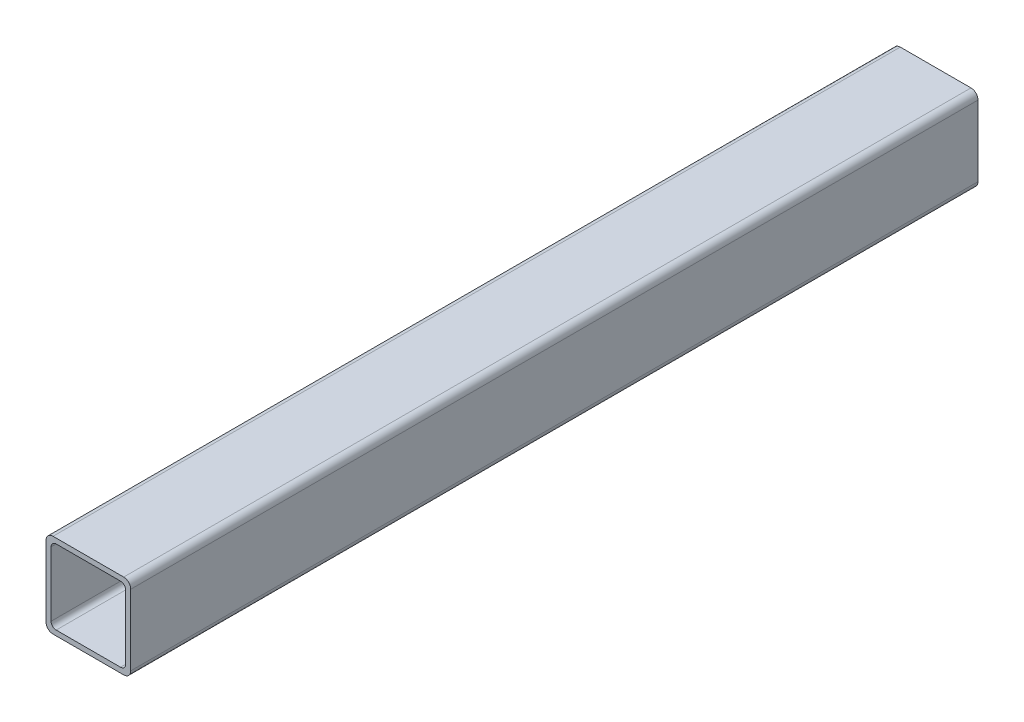
ISO-10303-21;
HEADER;
FILE_DESCRIPTION(('STEP AP214'),'2;1');
FILE_NAME('part.step','',(''),(''),'','','');
FILE_SCHEMA(('AUTOMOTIVE_DESIGN { 1 0 10303 214 1 1 1 1 }'));
ENDSEC;
DATA;
#1=APPLICATION_CONTEXT('core data for automotive mechanical design processes');
#2=APPLICATION_PROTOCOL_DEFINITION('international standard','automotive_design',2000,#1);
#3=PRODUCT_CONTEXT('',#1,'mechanical');
#4=PRODUCT('Part','Part','',(#3));
#5=PRODUCT_RELATED_PRODUCT_CATEGORY('part','',(#4));
#6=PRODUCT_DEFINITION_FORMATION('','',#4);
#7=PRODUCT_DEFINITION_CONTEXT('part definition',#1,'design');
#8=PRODUCT_DEFINITION('design','',#6,#7);
#9=PRODUCT_DEFINITION_SHAPE('','',#8);
#10=(LENGTH_UNIT() NAMED_UNIT(*) SI_UNIT(.MILLI.,.METRE.));
#11=(NAMED_UNIT(*) PLANE_ANGLE_UNIT() SI_UNIT($,.RADIAN.));
#12=(NAMED_UNIT(*) SI_UNIT($,.STERADIAN.) SOLID_ANGLE_UNIT());
#13=UNCERTAINTY_MEASURE_WITH_UNIT(LENGTH_MEASURE(1.E-05),#10,'distance_accuracy_value','');
#14=(GEOMETRIC_REPRESENTATION_CONTEXT(3) GLOBAL_UNCERTAINTY_ASSIGNED_CONTEXT((#13)) GLOBAL_UNIT_ASSIGNED_CONTEXT((#10,
#11,#12)) REPRESENTATION_CONTEXT('',''));
#15=CARTESIAN_POINT('',(0.,0.,0.));
#16=DIRECTION('',(0.,0.,1.));
#17=DIRECTION('',(1.,0.,0.));
#18=AXIS2_PLACEMENT_3D('',#15,#16,#17);
#19=CARTESIAN_POINT('',(-12.7,10.5918,-254.));
#20=DIRECTION('',(-1.,0.,0.));
#21=DIRECTION('',(0.,0.,1.));
#22=AXIS2_PLACEMENT_3D('',#19,#20,#21);
#23=PLANE('',#22);
#24=DIRECTION('',(0.,-1.,0.));
#25=VECTOR('',#24,1.);
#26=CARTESIAN_POINT('',(-12.7,10.5918,0.));
#27=LINE('',#26,#25);
#28=CARTESIAN_POINT('',(-12.7,10.5918,0.));
#29=VERTEX_POINT('',#28);
#30=CARTESIAN_POINT('',(-12.7,-10.5918,0.));
#31=VERTEX_POINT('',#30);
#32=EDGE_CURVE('E11',#29,#31,#27,.T.);
#33=ORIENTED_EDGE('',*,*,#32,.F.);
#34=DIRECTION('',(0.,0.,1.));
#35=VECTOR('',#34,1.);
#36=CARTESIAN_POINT('',(-12.7,10.5918,-254.));
#37=LINE('',#36,#35);
#38=CARTESIAN_POINT('',(-12.7,10.5918,-254.));
#39=VERTEX_POINT('',#38);
#40=EDGE_CURVE('E25',#39,#29,#37,.T.);
#41=ORIENTED_EDGE('',*,*,#40,.F.);
#42=DIRECTION('',(0.,-1.,0.));
#43=VECTOR('',#42,1.);
#44=CARTESIAN_POINT('',(-12.7,10.5918,-254.));
#45=LINE('',#44,#43);
#46=CARTESIAN_POINT('',(-12.7,-10.5918,-254.));
#47=VERTEX_POINT('',#46);
#48=EDGE_CURVE('E331',#39,#47,#45,.T.);
#49=ORIENTED_EDGE('',*,*,#48,.T.);
#50=DIRECTION('',(0.,0.,1.));
#51=VECTOR('',#50,1.);
#52=CARTESIAN_POINT('',(-12.7,-10.5918,-254.));
#53=LINE('',#52,#51);
#54=EDGE_CURVE('E327',#47,#31,#53,.T.);
#55=ORIENTED_EDGE('',*,*,#54,.T.);
#56=EDGE_LOOP('',(#33,#41,#49,#55));
#57=FACE_BOUND('',#56,.T.);
#58=ADVANCED_FACE('F17',(#57),#23,.T.);
#59=CARTESIAN_POINT('',(-10.5917999999997,-10.5917999999997,-254.));
#60=DIRECTION('',(0.,0.,1.));
#61=DIRECTION('',(0.707106781186548,0.707106781186548,0.));
#62=AXIS2_PLACEMENT_3D('',#59,#60,#61);
#63=CYLINDRICAL_SURFACE('',#62,2.10820000000029);
#64=CARTESIAN_POINT('',(-10.5917999999997,-10.5917999999997,0.));
#65=DIRECTION('',(0.,0.,1.));
#66=DIRECTION('',(1.,0.,0.));
#67=AXIS2_PLACEMENT_3D('',#64,#65,#66);
#68=CIRCLE('',#67,2.10820000000029);
#69=CARTESIAN_POINT('',(-10.5918,-12.7,0.));
#70=VERTEX_POINT('',#69);
#71=EDGE_CURVE('E322',#31,#70,#68,.T.);
#72=ORIENTED_EDGE('',*,*,#71,.F.);
#73=ORIENTED_EDGE('',*,*,#54,.F.);
#74=CARTESIAN_POINT('',(-10.5917999999997,-10.5917999999997,-254.));
#75=DIRECTION('',(0.,0.,1.));
#76=DIRECTION('',(1.,0.,0.));
#77=AXIS2_PLACEMENT_3D('',#74,#75,#76);
#78=CIRCLE('',#77,2.10820000000029);
#79=CARTESIAN_POINT('',(-10.5918,-12.7,-254.));
#80=VERTEX_POINT('',#79);
#81=EDGE_CURVE('E318',#47,#80,#78,.T.);
#82=ORIENTED_EDGE('',*,*,#81,.T.);
#83=DIRECTION('',(0.,0.,1.));
#84=VECTOR('',#83,1.);
#85=CARTESIAN_POINT('',(-10.5918,-12.7,-254.));
#86=LINE('',#85,#84);
#87=EDGE_CURVE('E314',#80,#70,#86,.T.);
#88=ORIENTED_EDGE('',*,*,#87,.T.);
#89=EDGE_LOOP('',(#72,#73,#82,#88));
#90=FACE_BOUND('',#89,.T.);
#91=ADVANCED_FACE('F353',(#90),#63,.T.);
#92=CARTESIAN_POINT('',(-10.5918,-12.7,-254.));
#93=DIRECTION('',(0.,-1.,0.));
#94=DIRECTION('',(0.,0.,-1.));
#95=AXIS2_PLACEMENT_3D('',#92,#93,#94);
#96=PLANE('',#95);
#97=DIRECTION('',(1.,0.,0.));
#98=VECTOR('',#97,1.);
#99=CARTESIAN_POINT('',(-10.5918,-12.7,0.));
#100=LINE('',#99,#98);
#101=CARTESIAN_POINT('',(10.5918,-12.7,0.));
#102=VERTEX_POINT('',#101);
#103=EDGE_CURVE('E309',#70,#102,#100,.T.);
#104=ORIENTED_EDGE('',*,*,#103,.F.);
#105=ORIENTED_EDGE('',*,*,#87,.F.);
#106=DIRECTION('',(1.,0.,0.));
#107=VECTOR('',#106,1.);
#108=CARTESIAN_POINT('',(-10.5918,-12.7,-254.));
#109=LINE('',#108,#107);
#110=CARTESIAN_POINT('',(10.5918,-12.7,-254.));
#111=VERTEX_POINT('',#110);
#112=EDGE_CURVE('E305',#80,#111,#109,.T.);
#113=ORIENTED_EDGE('',*,*,#112,.T.);
#114=DIRECTION('',(0.,0.,1.));
#115=VECTOR('',#114,1.);
#116=CARTESIAN_POINT('',(10.5918,-12.7,-254.));
#117=LINE('',#116,#115);
#118=EDGE_CURVE('E301',#111,#102,#117,.T.);
#119=ORIENTED_EDGE('',*,*,#118,.T.);
#120=EDGE_LOOP('',(#104,#105,#113,#119));
#121=FACE_BOUND('',#120,.T.);
#122=ADVANCED_FACE('F376',(#121),#96,.T.);
#123=CARTESIAN_POINT('',(10.5917999999997,-10.5917999999997,-254.));
#124=DIRECTION('',(0.,0.,1.));
#125=DIRECTION('',(-0.707106781186597,0.707106781186498,0.));
#126=AXIS2_PLACEMENT_3D('',#123,#124,#125);
#127=CYLINDRICAL_SURFACE('',#126,2.10820000000029);
#128=CARTESIAN_POINT('',(10.5917999999997,-10.5917999999997,0.));
#129=DIRECTION('',(0.,0.,1.));
#130=DIRECTION('',(1.,0.,0.));
#131=AXIS2_PLACEMENT_3D('',#128,#129,#130);
#132=CIRCLE('',#131,2.10820000000029);
#133=CARTESIAN_POINT('',(12.7,-10.5918,0.));
#134=VERTEX_POINT('',#133);
#135=EDGE_CURVE('E296',#102,#134,#132,.T.);
#136=ORIENTED_EDGE('',*,*,#135,.F.);
#137=ORIENTED_EDGE('',*,*,#118,.F.);
#138=CARTESIAN_POINT('',(10.5917999999997,-10.5917999999997,-254.));
#139=DIRECTION('',(0.,0.,1.));
#140=DIRECTION('',(1.,0.,0.));
#141=AXIS2_PLACEMENT_3D('',#138,#139,#140);
#142=CIRCLE('',#141,2.10820000000029);
#143=CARTESIAN_POINT('',(12.7,-10.5918,-254.));
#144=VERTEX_POINT('',#143);
#145=EDGE_CURVE('E292',#111,#144,#142,.T.);
#146=ORIENTED_EDGE('',*,*,#145,.T.);
#147=DIRECTION('',(0.,0.,1.));
#148=VECTOR('',#147,1.);
#149=CARTESIAN_POINT('',(12.7,-10.5918,-254.));
#150=LINE('',#149,#148);
#151=EDGE_CURVE('E288',#144,#134,#150,.T.);
#152=ORIENTED_EDGE('',*,*,#151,.T.);
#153=EDGE_LOOP('',(#136,#137,#146,#152));
#154=FACE_BOUND('',#153,.T.);
#155=ADVANCED_FACE('F373',(#154),#127,.T.);
#156=CARTESIAN_POINT('',(12.7,-10.5918,-254.));
#157=DIRECTION('',(1.,0.,0.));
#158=DIRECTION('',(0.,0.,-1.));
#159=AXIS2_PLACEMENT_3D('',#156,#157,#158);
#160=PLANE('',#159);
#161=DIRECTION('',(0.,1.,0.));
#162=VECTOR('',#161,1.);
#163=CARTESIAN_POINT('',(12.7,-10.5918,0.));
#164=LINE('',#163,#162);
#165=CARTESIAN_POINT('',(12.7,10.5918,0.));
#166=VERTEX_POINT('',#165);
#167=EDGE_CURVE('E283',#134,#166,#164,.T.);
#168=ORIENTED_EDGE('',*,*,#167,.F.);
#169=ORIENTED_EDGE('',*,*,#151,.F.);
#170=DIRECTION('',(0.,1.,0.));
#171=VECTOR('',#170,1.);
#172=CARTESIAN_POINT('',(12.7,-10.5918,-254.));
#173=LINE('',#172,#171);
#174=CARTESIAN_POINT('',(12.7,10.5918,-254.));
#175=VERTEX_POINT('',#174);
#176=EDGE_CURVE('E279',#144,#175,#173,.T.);
#177=ORIENTED_EDGE('',*,*,#176,.T.);
#178=DIRECTION('',(0.,0.,1.));
#179=VECTOR('',#178,1.);
#180=CARTESIAN_POINT('',(12.7,10.5918,-254.));
#181=LINE('',#180,#179);
#182=EDGE_CURVE('E275',#175,#166,#181,.T.);
#183=ORIENTED_EDGE('',*,*,#182,.T.);
#184=EDGE_LOOP('',(#168,#169,#177,#183));
#185=FACE_BOUND('',#184,.T.);
#186=ADVANCED_FACE('F370',(#185),#160,.T.);
#187=CARTESIAN_POINT('',(10.5917999999997,10.5917999999997,-254.));
#188=DIRECTION('',(0.,0.,1.));
#189=DIRECTION('',(-0.707106781186547,-0.707106781186548,0.));
#190=AXIS2_PLACEMENT_3D('',#187,#188,#189);
#191=CYLINDRICAL_SURFACE('',#190,2.10820000000029);
#192=CARTESIAN_POINT('',(10.5917999999997,10.5917999999997,0.));
#193=DIRECTION('',(0.,0.,1.));
#194=DIRECTION('',(1.,0.,0.));
#195=AXIS2_PLACEMENT_3D('',#192,#193,#194);
#196=CIRCLE('',#195,2.10820000000029);
#197=CARTESIAN_POINT('',(10.5918,12.7,0.));
#198=VERTEX_POINT('',#197);
#199=EDGE_CURVE('E270',#166,#198,#196,.T.);
#200=ORIENTED_EDGE('',*,*,#199,.F.);
#201=ORIENTED_EDGE('',*,*,#182,.F.);
#202=CARTESIAN_POINT('',(10.5917999999997,10.5917999999997,-254.));
#203=DIRECTION('',(0.,0.,1.));
#204=DIRECTION('',(1.,0.,0.));
#205=AXIS2_PLACEMENT_3D('',#202,#203,#204);
#206=CIRCLE('',#205,2.10820000000029);
#207=CARTESIAN_POINT('',(10.5918,12.7,-254.));
#208=VERTEX_POINT('',#207);
#209=EDGE_CURVE('E266',#175,#208,#206,.T.);
#210=ORIENTED_EDGE('',*,*,#209,.T.);
#211=DIRECTION('',(0.,0.,1.));
#212=VECTOR('',#211,1.);
#213=CARTESIAN_POINT('',(10.5918,12.7,-254.));
#214=LINE('',#213,#212);
#215=EDGE_CURVE('E262',#208,#198,#214,.T.);
#216=ORIENTED_EDGE('',*,*,#215,.T.);
#217=EDGE_LOOP('',(#200,#201,#210,#216));
#218=FACE_BOUND('',#217,.T.);
#219=ADVANCED_FACE('F367',(#218),#191,.T.);
#220=CARTESIAN_POINT('',(10.5918,12.7,-254.));
#221=DIRECTION('',(0.,1.,0.));
#222=DIRECTION('',(0.,0.,1.));
#223=AXIS2_PLACEMENT_3D('',#220,#221,#222);
#224=PLANE('',#223);
#225=DIRECTION('',(-1.,0.,0.));
#226=VECTOR('',#225,1.);
#227=CARTESIAN_POINT('',(10.5918,12.7,0.));
#228=LINE('',#227,#226);
#229=CARTESIAN_POINT('',(-10.5918,12.7,0.));
#230=VERTEX_POINT('',#229);
#231=EDGE_CURVE('E257',#198,#230,#228,.T.);
#232=ORIENTED_EDGE('',*,*,#231,.F.);
#233=ORIENTED_EDGE('',*,*,#215,.F.);
#234=DIRECTION('',(-1.,0.,0.));
#235=VECTOR('',#234,1.);
#236=CARTESIAN_POINT('',(10.5918,12.7,-254.));
#237=LINE('',#236,#235);
#238=CARTESIAN_POINT('',(-10.5918,12.7,-254.));
#239=VERTEX_POINT('',#238);
#240=EDGE_CURVE('E253',#208,#239,#237,.T.);
#241=ORIENTED_EDGE('',*,*,#240,.T.);
#242=DIRECTION('',(0.,0.,1.));
#243=VECTOR('',#242,1.);
#244=CARTESIAN_POINT('',(-10.5918,12.7,-254.));
#245=LINE('',#244,#243);
#246=EDGE_CURVE('E249',#239,#230,#245,.T.);
#247=ORIENTED_EDGE('',*,*,#246,.T.);
#248=EDGE_LOOP('',(#232,#233,#241,#247));
#249=FACE_BOUND('',#248,.T.);
#250=ADVANCED_FACE('F360',(#249),#224,.T.);
#251=CARTESIAN_POINT('',(-10.5917999999997,10.5917999999997,-254.));
#252=DIRECTION('',(0.,0.,1.));
#253=DIRECTION('',(0.707106781186548,-0.707106781186547,0.));
#254=AXIS2_PLACEMENT_3D('',#251,#252,#253);
#255=CYLINDRICAL_SURFACE('',#254,2.10820000000029);
#256=CARTESIAN_POINT('',(-10.5917999999997,10.5917999999997,0.));
#257=DIRECTION('',(0.,0.,1.));
#258=DIRECTION('',(1.,0.,0.));
#259=AXIS2_PLACEMENT_3D('',#256,#257,#258);
#260=CIRCLE('',#259,2.10820000000029);
#261=EDGE_CURVE('E245',#230,#29,#260,.T.);
#262=ORIENTED_EDGE('',*,*,#261,.F.);
#263=ORIENTED_EDGE('',*,*,#246,.F.);
#264=CARTESIAN_POINT('',(-10.5917999999997,10.5917999999997,-254.));
#265=DIRECTION('',(0.,0.,1.));
#266=DIRECTION('',(1.,0.,0.));
#267=AXIS2_PLACEMENT_3D('',#264,#265,#266);
#268=CIRCLE('',#267,2.10820000000029);
#269=EDGE_CURVE('E241',#239,#39,#268,.T.);
#270=ORIENTED_EDGE('',*,*,#269,.T.);
#271=ORIENTED_EDGE('',*,*,#40,.T.);
#272=EDGE_LOOP('',(#262,#263,#270,#271));
#273=FACE_BOUND('',#272,.T.);
#274=ADVANCED_FACE('F341',(#273),#255,.T.);
#275=CARTESIAN_POINT('',(-10.5917999999997,-10.5917999999997,-254.));
#276=DIRECTION('',(0.,0.,1.));
#277=DIRECTION('',(1.,0.,0.));
#278=AXIS2_PLACEMENT_3D('',#275,#276,#277);
#279=PLANE('',#278);
#280=DIRECTION('',(0.,-1.,0.));
#281=VECTOR('',#280,1.);
#282=CARTESIAN_POINT('',(-11.176,9.652,-254.));
#283=LINE('',#282,#281);
#284=CARTESIAN_POINT('',(-11.176,9.652,-254.));
#285=VERTEX_POINT('',#284);
#286=CARTESIAN_POINT('',(-11.176,-9.652,-254.));
#287=VERTEX_POINT('',#286);
#288=EDGE_CURVE('E237',#285,#287,#283,.T.);
#289=ORIENTED_EDGE('',*,*,#288,.T.);
#290=CARTESIAN_POINT('',(-9.65199999999975,-9.65199999999975,-254.));
#291=DIRECTION('',(0.,0.,1.));
#292=DIRECTION('',(1.,0.,0.));
#293=AXIS2_PLACEMENT_3D('',#290,#291,#292);
#294=CIRCLE('',#293,1.52400000000025);
#295=CARTESIAN_POINT('',(-9.652,-11.176,-254.));
#296=VERTEX_POINT('',#295);
#297=EDGE_CURVE('E134',#287,#296,#294,.T.);
#298=ORIENTED_EDGE('',*,*,#297,.T.);
#299=DIRECTION('',(1.,0.,0.));
#300=VECTOR('',#299,1.);
#301=CARTESIAN_POINT('',(-9.652,-11.176,-254.));
#302=LINE('',#301,#300);
#303=CARTESIAN_POINT('',(9.652,-11.176,-254.));
#304=VERTEX_POINT('',#303);
#305=EDGE_CURVE('E230',#296,#304,#302,.T.);
#306=ORIENTED_EDGE('',*,*,#305,.T.);
#307=CARTESIAN_POINT('',(9.65199999999975,-9.65199999999975,-254.));
#308=DIRECTION('',(0.,0.,1.));
#309=DIRECTION('',(1.,0.,0.));
#310=AXIS2_PLACEMENT_3D('',#307,#308,#309);
#311=CIRCLE('',#310,1.52400000000025);
#312=CARTESIAN_POINT('',(11.176,-9.652,-254.));
#313=VERTEX_POINT('',#312);
#314=EDGE_CURVE('E226',#304,#313,#311,.T.);
#315=ORIENTED_EDGE('',*,*,#314,.T.);
#316=DIRECTION('',(0.,1.,0.));
#317=VECTOR('',#316,1.);
#318=CARTESIAN_POINT('',(11.176,-9.652,-254.));
#319=LINE('',#318,#317);
#320=CARTESIAN_POINT('',(11.176,9.652,-254.));
#321=VERTEX_POINT('',#320);
#322=EDGE_CURVE('E222',#313,#321,#319,.T.);
#323=ORIENTED_EDGE('',*,*,#322,.T.);
#324=CARTESIAN_POINT('',(9.65199999999975,9.65199999999975,-254.));
#325=DIRECTION('',(0.,0.,1.));
#326=DIRECTION('',(1.,0.,0.));
#327=AXIS2_PLACEMENT_3D('',#324,#325,#326);
#328=CIRCLE('',#327,1.52400000000025);
#329=CARTESIAN_POINT('',(9.652,11.176,-254.));
#330=VERTEX_POINT('',#329);
#331=EDGE_CURVE('E218',#321,#330,#328,.T.);
#332=ORIENTED_EDGE('',*,*,#331,.T.);
#333=DIRECTION('',(-1.,0.,0.));
#334=VECTOR('',#333,1.);
#335=CARTESIAN_POINT('',(9.652,11.176,-254.));
#336=LINE('',#335,#334);
#337=CARTESIAN_POINT('',(-9.652,11.176,-254.));
#338=VERTEX_POINT('',#337);
#339=EDGE_CURVE('E214',#330,#338,#336,.T.);
#340=ORIENTED_EDGE('',*,*,#339,.T.);
#341=CARTESIAN_POINT('',(-9.65199999999975,9.65199999999975,-254.));
#342=DIRECTION('',(0.,0.,1.));
#343=DIRECTION('',(1.,0.,0.));
#344=AXIS2_PLACEMENT_3D('',#341,#342,#343);
#345=CIRCLE('',#344,1.52400000000025);
#346=EDGE_CURVE('E210',#338,#285,#345,.T.);
#347=ORIENTED_EDGE('',*,*,#346,.T.);
#348=EDGE_LOOP('',(#289,#298,#306,#315,#323,#332,#340,#347));
#349=FACE_BOUND('',#348,.T.);
#350=ORIENTED_EDGE('',*,*,#48,.F.);
#351=ORIENTED_EDGE('',*,*,#269,.F.);
#352=ORIENTED_EDGE('',*,*,#240,.F.);
#353=ORIENTED_EDGE('',*,*,#209,.F.);
#354=ORIENTED_EDGE('',*,*,#176,.F.);
#355=ORIENTED_EDGE('',*,*,#145,.F.);
#356=ORIENTED_EDGE('',*,*,#112,.F.);
#357=ORIENTED_EDGE('',*,*,#81,.F.);
#358=EDGE_LOOP('',(#350,#351,#352,#353,#354,#355,#356,#357));
#359=FACE_BOUND('',#358,.T.);
#360=ADVANCED_FACE('F348',(#349,#359),#279,.F.);
#361=CARTESIAN_POINT('',(-9.65199999999975,9.65199999999975,-254.));
#362=DIRECTION('',(0.,0.,1.));
#363=DIRECTION('',(0.707106781186548,-0.707106781186548,0.));
#364=AXIS2_PLACEMENT_3D('',#361,#362,#363);
#365=CYLINDRICAL_SURFACE('',#364,1.52400000000025);
#366=CARTESIAN_POINT('',(-9.65199999999975,9.65199999999975,0.));
#367=DIRECTION('',(0.,0.,1.));
#368=DIRECTION('',(1.,0.,0.));
#369=AXIS2_PLACEMENT_3D('',#366,#367,#368);
#370=CIRCLE('',#369,1.52400000000025);
#371=CARTESIAN_POINT('',(-9.652,11.176,0.));
#372=VERTEX_POINT('',#371);
#373=CARTESIAN_POINT('',(-11.176,9.652,0.));
#374=VERTEX_POINT('',#373);
#375=EDGE_CURVE('E206',#372,#374,#370,.T.);
#376=ORIENTED_EDGE('',*,*,#375,.T.);
#377=DIRECTION('',(0.,0.,1.));
#378=VECTOR('',#377,1.);
#379=CARTESIAN_POINT('',(-11.176,9.652,-254.));
#380=LINE('',#379,#378);
#381=EDGE_CURVE('E143',#285,#374,#380,.T.);
#382=ORIENTED_EDGE('',*,*,#381,.F.);
#383=ORIENTED_EDGE('',*,*,#346,.F.);
#384=DIRECTION('',(0.,0.,1.));
#385=VECTOR('',#384,1.);
#386=CARTESIAN_POINT('',(-9.652,11.176,-254.));
#387=LINE('',#386,#385);
#388=EDGE_CURVE('E199',#338,#372,#387,.T.);
#389=ORIENTED_EDGE('',*,*,#388,.T.);
#390=EDGE_LOOP('',(#376,#382,#383,#389));
#391=FACE_BOUND('',#390,.T.);
#392=ADVANCED_FACE('F447',(#391),#365,.F.);
#393=CARTESIAN_POINT('',(9.652,11.176,-254.));
#394=DIRECTION('',(0.,1.,0.));
#395=DIRECTION('',(0.,0.,1.));
#396=AXIS2_PLACEMENT_3D('',#393,#394,#395);
#397=PLANE('',#396);
#398=DIRECTION('',(-1.,0.,0.));
#399=VECTOR('',#398,1.);
#400=CARTESIAN_POINT('',(9.652,11.176,0.));
#401=LINE('',#400,#399);
#402=CARTESIAN_POINT('',(9.652,11.176,0.));
#403=VERTEX_POINT('',#402);
#404=EDGE_CURVE('E194',#403,#372,#401,.T.);
#405=ORIENTED_EDGE('',*,*,#404,.T.);
#406=ORIENTED_EDGE('',*,*,#388,.F.);
#407=ORIENTED_EDGE('',*,*,#339,.F.);
#408=DIRECTION('',(0.,0.,1.));
#409=VECTOR('',#408,1.);
#410=CARTESIAN_POINT('',(9.652,11.176,-254.));
#411=LINE('',#410,#409);
#412=EDGE_CURVE('E190',#330,#403,#411,.T.);
#413=ORIENTED_EDGE('',*,*,#412,.T.);
#414=EDGE_LOOP('',(#405,#406,#407,#413));
#415=FACE_BOUND('',#414,.T.);
#416=ADVANCED_FACE('F457',(#415),#397,.F.);
#417=CARTESIAN_POINT('',(9.65199999999975,9.65199999999975,-254.));
#418=DIRECTION('',(0.,0.,1.));
#419=DIRECTION('',(-0.707106781186489,-0.707106781186606,0.));
#420=AXIS2_PLACEMENT_3D('',#417,#418,#419);
#421=CYLINDRICAL_SURFACE('',#420,1.52400000000025);
#422=CARTESIAN_POINT('',(9.65199999999975,9.65199999999975,0.));
#423=DIRECTION('',(0.,0.,1.));
#424=DIRECTION('',(1.,0.,0.));
#425=AXIS2_PLACEMENT_3D('',#422,#423,#424);
#426=CIRCLE('',#425,1.52400000000025);
#427=CARTESIAN_POINT('',(11.176,9.652,0.));
#428=VERTEX_POINT('',#427);
#429=EDGE_CURVE('E185',#428,#403,#426,.T.);
#430=ORIENTED_EDGE('',*,*,#429,.T.);
#431=ORIENTED_EDGE('',*,*,#412,.F.);
#432=ORIENTED_EDGE('',*,*,#331,.F.);
#433=DIRECTION('',(0.,0.,1.));
#434=VECTOR('',#433,1.);
#435=CARTESIAN_POINT('',(11.176,9.652,-254.));
#436=LINE('',#435,#434);
#437=EDGE_CURVE('E181',#321,#428,#436,.T.);
#438=ORIENTED_EDGE('',*,*,#437,.T.);
#439=EDGE_LOOP('',(#430,#431,#432,#438));
#440=FACE_BOUND('',#439,.T.);
#441=ADVANCED_FACE('F467',(#440),#421,.F.);
#442=CARTESIAN_POINT('',(11.176,-9.652,-254.));
#443=DIRECTION('',(1.,0.,0.));
#444=DIRECTION('',(0.,0.,-1.));
#445=AXIS2_PLACEMENT_3D('',#442,#443,#444);
#446=PLANE('',#445);
#447=DIRECTION('',(0.,1.,0.));
#448=VECTOR('',#447,1.);
#449=CARTESIAN_POINT('',(11.176,-9.652,0.));
#450=LINE('',#449,#448);
#451=CARTESIAN_POINT('',(11.176,-9.652,0.));
#452=VERTEX_POINT('',#451);
#453=EDGE_CURVE('E176',#452,#428,#450,.T.);
#454=ORIENTED_EDGE('',*,*,#453,.T.);
#455=ORIENTED_EDGE('',*,*,#437,.F.);
#456=ORIENTED_EDGE('',*,*,#322,.F.);
#457=DIRECTION('',(0.,0.,1.));
#458=VECTOR('',#457,1.);
#459=CARTESIAN_POINT('',(11.176,-9.652,-254.));
#460=LINE('',#459,#458);
#461=EDGE_CURVE('E172',#313,#452,#460,.T.);
#462=ORIENTED_EDGE('',*,*,#461,.T.);
#463=EDGE_LOOP('',(#454,#455,#456,#462));
#464=FACE_BOUND('',#463,.T.);
#465=ADVANCED_FACE('F477',(#464),#446,.F.);
#466=CARTESIAN_POINT('',(9.65199999999975,-9.65199999999975,-254.));
#467=DIRECTION('',(0.,0.,1.));
#468=DIRECTION('',(-0.707106781186606,0.707106781186489,0.));
#469=AXIS2_PLACEMENT_3D('',#466,#467,#468);
#470=CYLINDRICAL_SURFACE('',#469,1.52400000000025);
#471=CARTESIAN_POINT('',(9.65199999999975,-9.65199999999975,0.));
#472=DIRECTION('',(0.,0.,1.));
#473=DIRECTION('',(1.,0.,0.));
#474=AXIS2_PLACEMENT_3D('',#471,#472,#473);
#475=CIRCLE('',#474,1.52400000000025);
#476=CARTESIAN_POINT('',(9.652,-11.176,0.));
#477=VERTEX_POINT('',#476);
#478=EDGE_CURVE('E167',#477,#452,#475,.T.);
#479=ORIENTED_EDGE('',*,*,#478,.T.);
#480=ORIENTED_EDGE('',*,*,#461,.F.);
#481=ORIENTED_EDGE('',*,*,#314,.F.);
#482=DIRECTION('',(0.,0.,1.));
#483=VECTOR('',#482,1.);
#484=CARTESIAN_POINT('',(9.652,-11.176,-254.));
#485=LINE('',#484,#483);
#486=EDGE_CURVE('E163',#304,#477,#485,.T.);
#487=ORIENTED_EDGE('',*,*,#486,.T.);
#488=EDGE_LOOP('',(#479,#480,#481,#487));
#489=FACE_BOUND('',#488,.T.);
#490=ADVANCED_FACE('F487',(#489),#470,.F.);
#491=CARTESIAN_POINT('',(-9.652,-11.176,-254.));
#492=DIRECTION('',(0.,-1.,0.));
#493=DIRECTION('',(0.,0.,-1.));
#494=AXIS2_PLACEMENT_3D('',#491,#492,#493);
#495=PLANE('',#494);
#496=DIRECTION('',(1.,0.,0.));
#497=VECTOR('',#496,1.);
#498=CARTESIAN_POINT('',(-9.652,-11.176,0.));
#499=LINE('',#498,#497);
#500=CARTESIAN_POINT('',(-9.652,-11.176,0.));
#501=VERTEX_POINT('',#500);
#502=EDGE_CURVE('E151',#501,#477,#499,.T.);
#503=ORIENTED_EDGE('',*,*,#502,.T.);
#504=ORIENTED_EDGE('',*,*,#486,.F.);
#505=ORIENTED_EDGE('',*,*,#305,.F.);
#506=DIRECTION('',(0.,0.,1.));
#507=VECTOR('',#506,1.);
#508=CARTESIAN_POINT('',(-9.652,-11.176,-254.));
#509=LINE('',#508,#507);
#510=EDGE_CURVE('E152',#296,#501,#509,.T.);
#511=ORIENTED_EDGE('',*,*,#510,.T.);
#512=EDGE_LOOP('',(#503,#504,#505,#511));
#513=FACE_BOUND('',#512,.T.);
#514=ADVANCED_FACE('F497',(#513),#495,.F.);
#515=CARTESIAN_POINT('',(-9.65199999999975,-9.65199999999975,-254.));
#516=DIRECTION('',(0.,0.,1.));
#517=DIRECTION('',(0.707106781186548,0.707106781186548,0.));
#518=AXIS2_PLACEMENT_3D('',#515,#516,#517);
#519=CYLINDRICAL_SURFACE('',#518,1.52400000000025);
#520=CARTESIAN_POINT('',(-9.65199999999975,-9.65199999999975,0.));
#521=DIRECTION('',(0.,0.,1.));
#522=DIRECTION('',(1.,0.,0.));
#523=AXIS2_PLACEMENT_3D('',#520,#521,#522);
#524=CIRCLE('',#523,1.52400000000025);
#525=CARTESIAN_POINT('',(-11.176,-9.652,0.));
#526=VERTEX_POINT('',#525);
#527=EDGE_CURVE('E132',#526,#501,#524,.T.);
#528=ORIENTED_EDGE('',*,*,#527,.T.);
#529=ORIENTED_EDGE('',*,*,#510,.F.);
#530=ORIENTED_EDGE('',*,*,#297,.F.);
#531=DIRECTION('',(0.,0.,1.));
#532=VECTOR('',#531,1.);
#533=CARTESIAN_POINT('',(-11.176,-9.652,-254.));
#534=LINE('',#533,#532);
#535=EDGE_CURVE('E127',#287,#526,#534,.T.);
#536=ORIENTED_EDGE('',*,*,#535,.T.);
#537=EDGE_LOOP('',(#528,#529,#530,#536));
#538=FACE_BOUND('',#537,.T.);
#539=ADVANCED_FACE('F129',(#538),#519,.F.);
#540=CARTESIAN_POINT('',(-11.176,9.652,-254.));
#541=DIRECTION('',(-1.,0.,0.));
#542=DIRECTION('',(0.,0.,1.));
#543=AXIS2_PLACEMENT_3D('',#540,#541,#542);
#544=PLANE('',#543);
#545=DIRECTION('',(0.,-1.,0.));
#546=VECTOR('',#545,1.);
#547=CARTESIAN_POINT('',(-11.176,9.652,0.));
#548=LINE('',#547,#546);
#549=EDGE_CURVE('E137',#374,#526,#548,.T.);
#550=ORIENTED_EDGE('',*,*,#549,.T.);
#551=ORIENTED_EDGE('',*,*,#535,.F.);
#552=ORIENTED_EDGE('',*,*,#288,.F.);
#553=ORIENTED_EDGE('',*,*,#381,.T.);
#554=EDGE_LOOP('',(#550,#551,#552,#553));
#555=FACE_BOUND('',#554,.T.);
#556=ADVANCED_FACE('F141',(#555),#544,.F.);
#557=CARTESIAN_POINT('',(-10.5917999999997,-10.5917999999997,0.));
#558=DIRECTION('',(0.,0.,1.));
#559=DIRECTION('',(1.,0.,0.));
#560=AXIS2_PLACEMENT_3D('',#557,#558,#559);
#561=PLANE('',#560);
#562=ORIENTED_EDGE('',*,*,#549,.F.);
#563=ORIENTED_EDGE('',*,*,#375,.F.);
#564=ORIENTED_EDGE('',*,*,#404,.F.);
#565=ORIENTED_EDGE('',*,*,#429,.F.);
#566=ORIENTED_EDGE('',*,*,#453,.F.);
#567=ORIENTED_EDGE('',*,*,#478,.F.);
#568=ORIENTED_EDGE('',*,*,#502,.F.);
#569=ORIENTED_EDGE('',*,*,#527,.F.);
#570=EDGE_LOOP('',(#562,#563,#564,#565,#566,#567,#568,#569));
#571=FACE_BOUND('',#570,.T.);
#572=ORIENTED_EDGE('',*,*,#32,.T.);
#573=ORIENTED_EDGE('',*,*,#71,.T.);
#574=ORIENTED_EDGE('',*,*,#103,.T.);
#575=ORIENTED_EDGE('',*,*,#135,.T.);
#576=ORIENTED_EDGE('',*,*,#167,.T.);
#577=ORIENTED_EDGE('',*,*,#199,.T.);
#578=ORIENTED_EDGE('',*,*,#231,.T.);
#579=ORIENTED_EDGE('',*,*,#261,.T.);
#580=EDGE_LOOP('',(#572,#573,#574,#575,#576,#577,#578,#579));
#581=FACE_BOUND('',#580,.T.);
#582=ADVANCED_FACE('F147',(#571,#581),#561,.T.);
#583=CLOSED_SHELL('',(#58,#91,#122,#155,#186,#219,#250,#274,#360,#392,#416,#441,#465,#490,#514,
#539,#556,#582));
#584=MANIFOLD_SOLID_BREP('B1',#583);
#585=ADVANCED_BREP_SHAPE_REPRESENTATION('',(#18,#584),#14);
#586=SHAPE_DEFINITION_REPRESENTATION(#9,#585);
ENDSEC;
END-ISO-10303-21;
